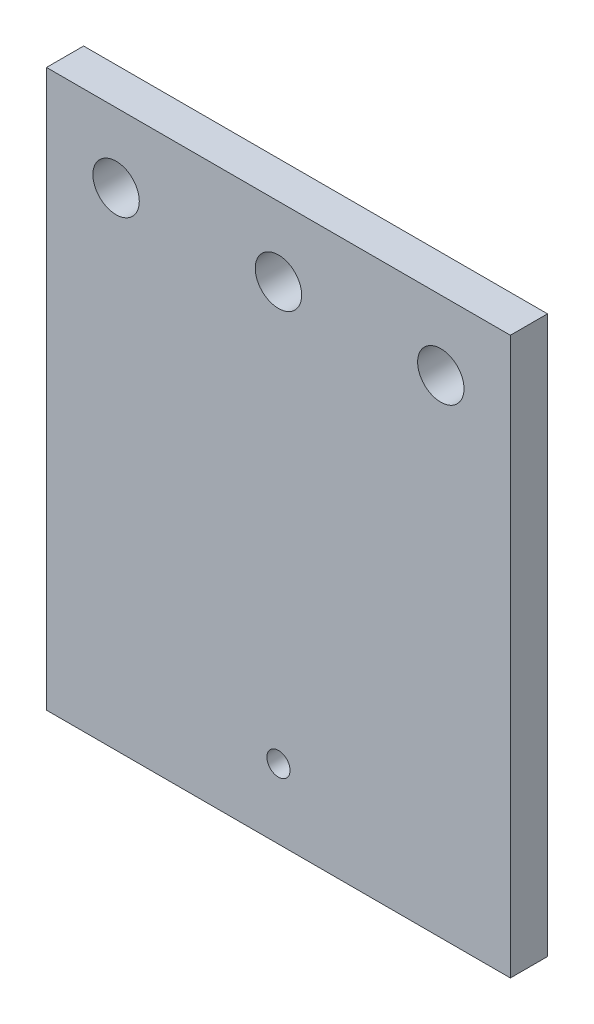
ISO-10303-21;
HEADER;
FILE_DESCRIPTION(('STEP AP214'),'2;1');
FILE_NAME('part.step','',(''),(''),'','','');
FILE_SCHEMA(('AUTOMOTIVE_DESIGN { 1 0 10303 214 1 1 1 1 }'));
ENDSEC;
DATA;
#1=APPLICATION_CONTEXT('core data for automotive mechanical design processes');
#2=APPLICATION_PROTOCOL_DEFINITION('international standard','automotive_design',2000,#1);
#3=PRODUCT_CONTEXT('',#1,'mechanical');
#4=PRODUCT('Part','Part','',(#3));
#5=PRODUCT_RELATED_PRODUCT_CATEGORY('part','',(#4));
#6=PRODUCT_DEFINITION_FORMATION('','',#4);
#7=PRODUCT_DEFINITION_CONTEXT('part definition',#1,'design');
#8=PRODUCT_DEFINITION('design','',#6,#7);
#9=PRODUCT_DEFINITION_SHAPE('','',#8);
#10=(LENGTH_UNIT() NAMED_UNIT(*) SI_UNIT(.MILLI.,.METRE.));
#11=(NAMED_UNIT(*) PLANE_ANGLE_UNIT() SI_UNIT($,.RADIAN.));
#12=(NAMED_UNIT(*) SI_UNIT($,.STERADIAN.) SOLID_ANGLE_UNIT());
#13=UNCERTAINTY_MEASURE_WITH_UNIT(LENGTH_MEASURE(1.E-05),#10,'distance_accuracy_value','');
#14=(GEOMETRIC_REPRESENTATION_CONTEXT(3) GLOBAL_UNCERTAINTY_ASSIGNED_CONTEXT((#13)) GLOBAL_UNIT_ASSIGNED_CONTEXT((#10,
#11,#12)) REPRESENTATION_CONTEXT('',''));
#15=CARTESIAN_POINT('',(0.,0.,0.));
#16=DIRECTION('',(0.,0.,1.));
#17=DIRECTION('',(1.,0.,0.));
#18=AXIS2_PLACEMENT_3D('',#15,#16,#17);
#19=CARTESIAN_POINT('',(0.,0.,10.16));
#20=DIRECTION('',(0.,0.,-1.));
#21=DIRECTION('',(-1.,0.,0.));
#22=AXIS2_PLACEMENT_3D('',#19,#20,#21);
#23=PLANE('',#22);
#24=DIRECTION('',(0.,-1.,0.));
#25=VECTOR('',#24,1.);
#26=CARTESIAN_POINT('',(0.,0.,10.16));
#27=LINE('',#26,#25);
#28=CARTESIAN_POINT('',(0.,152.4,10.16));
#29=VERTEX_POINT('',#28);
#30=CARTESIAN_POINT('',(0.,0.,10.16));
#31=VERTEX_POINT('',#30);
#32=EDGE_CURVE('E92',#29,#31,#27,.T.);
#33=ORIENTED_EDGE('',*,*,#32,.T.);
#34=DIRECTION('',(1.,0.,0.));
#35=VECTOR('',#34,1.);
#36=CARTESIAN_POINT('',(0.,0.,10.16));
#37=LINE('',#36,#35);
#38=CARTESIAN_POINT('',(127.,0.,10.16));
#39=VERTEX_POINT('',#38);
#40=EDGE_CURVE('E87',#31,#39,#37,.T.);
#41=ORIENTED_EDGE('',*,*,#40,.T.);
#42=DIRECTION('',(0.,1.,0.));
#43=VECTOR('',#42,1.);
#44=CARTESIAN_POINT('',(127.,0.,10.16));
#45=LINE('',#44,#43);
#46=CARTESIAN_POINT('',(127.,152.4,10.16));
#47=VERTEX_POINT('',#46);
#48=EDGE_CURVE('E90',#39,#47,#45,.T.);
#49=ORIENTED_EDGE('',*,*,#48,.T.);
#50=DIRECTION('',(-1.,0.,0.));
#51=VECTOR('',#50,1.);
#52=CARTESIAN_POINT('',(0.,152.4,10.16));
#53=LINE('',#52,#51);
#54=EDGE_CURVE('E57',#47,#29,#53,.T.);
#55=ORIENTED_EDGE('',*,*,#54,.T.);
#56=EDGE_LOOP('',(#33,#41,#49,#55));
#57=FACE_BOUND('',#56,.T.);
#58=CARTESIAN_POINT('',(63.5,19.05,10.16));
#59=DIRECTION('',(0.,0.,1.));
#60=DIRECTION('',(1.,0.,0.));
#61=AXIS2_PLACEMENT_3D('',#58,#59,#60);
#62=CIRCLE('',#61,3.175);
#63=CARTESIAN_POINT('',(66.675,19.05,10.16));
#64=VERTEX_POINT('',#63);
#65=EDGE_CURVE('E112',#64,#64,#62,.T.);
#66=ORIENTED_EDGE('',*,*,#65,.F.);
#67=EDGE_LOOP('',(#66));
#68=FACE_BOUND('',#67,.T.);
#69=CARTESIAN_POINT('',(19.05,133.35,10.16));
#70=DIRECTION('',(0.,0.,1.));
#71=DIRECTION('',(1.,0.,0.));
#72=AXIS2_PLACEMENT_3D('',#69,#70,#71);
#73=CIRCLE('',#72,6.35);
#74=CARTESIAN_POINT('',(25.4,133.35,10.16));
#75=VERTEX_POINT('',#74);
#76=EDGE_CURVE('E134',#75,#75,#73,.T.);
#77=ORIENTED_EDGE('',*,*,#76,.F.);
#78=EDGE_LOOP('',(#77));
#79=FACE_BOUND('',#78,.T.);
#80=CARTESIAN_POINT('',(63.5,133.35,10.16));
#81=DIRECTION('',(0.,0.,1.));
#82=DIRECTION('',(1.,0.,0.));
#83=AXIS2_PLACEMENT_3D('',#80,#81,#82);
#84=CIRCLE('',#83,6.34999999999999);
#85=CARTESIAN_POINT('',(69.85,133.35,10.16));
#86=VERTEX_POINT('',#85);
#87=EDGE_CURVE('E142',#86,#86,#84,.T.);
#88=ORIENTED_EDGE('',*,*,#87,.F.);
#89=EDGE_LOOP('',(#88));
#90=FACE_BOUND('',#89,.T.);
#91=CARTESIAN_POINT('',(107.95,133.35,10.16));
#92=DIRECTION('',(0.,0.,1.));
#93=DIRECTION('',(1.,0.,0.));
#94=AXIS2_PLACEMENT_3D('',#91,#92,#93);
#95=CIRCLE('',#94,6.34999999999999);
#96=CARTESIAN_POINT('',(114.3,133.35,10.16));
#97=VERTEX_POINT('',#96);
#98=EDGE_CURVE('E150',#97,#97,#95,.T.);
#99=ORIENTED_EDGE('',*,*,#98,.F.);
#100=EDGE_LOOP('',(#99));
#101=FACE_BOUND('',#100,.T.);
#102=ADVANCED_FACE('F39',(#57,#68,#79,#90,#101),#23,.F.);
#103=CARTESIAN_POINT('',(0.,0.,0.));
#104=DIRECTION('',(0.,0.,-1.));
#105=DIRECTION('',(-1.,0.,0.));
#106=AXIS2_PLACEMENT_3D('',#103,#104,#105);
#107=PLANE('',#106);
#108=CARTESIAN_POINT('',(63.5,133.35,0.));
#109=DIRECTION('',(0.,0.,1.));
#110=DIRECTION('',(1.,0.,0.));
#111=AXIS2_PLACEMENT_3D('',#108,#109,#110);
#112=CIRCLE('',#111,6.34999999999999);
#113=CARTESIAN_POINT('',(69.85,133.35,0.));
#114=VERTEX_POINT('',#113);
#115=EDGE_CURVE('E146',#114,#114,#112,.T.);
#116=ORIENTED_EDGE('',*,*,#115,.T.);
#117=EDGE_LOOP('',(#116));
#118=FACE_BOUND('',#117,.T.);
#119=CARTESIAN_POINT('',(63.5,19.05,0.));
#120=DIRECTION('',(0.,0.,1.));
#121=DIRECTION('',(1.,0.,0.));
#122=AXIS2_PLACEMENT_3D('',#119,#120,#121);
#123=CIRCLE('',#122,3.175);
#124=CARTESIAN_POINT('',(66.675,19.05,0.));
#125=VERTEX_POINT('',#124);
#126=EDGE_CURVE('E130',#125,#125,#123,.T.);
#127=ORIENTED_EDGE('',*,*,#126,.T.);
#128=EDGE_LOOP('',(#127));
#129=FACE_BOUND('',#128,.T.);
#130=DIRECTION('',(0.,-1.,0.));
#131=VECTOR('',#130,1.);
#132=CARTESIAN_POINT('',(0.,0.,0.));
#133=LINE('',#132,#131);
#134=CARTESIAN_POINT('',(0.,152.4,0.));
#135=VERTEX_POINT('',#134);
#136=CARTESIAN_POINT('',(0.,0.,0.));
#137=VERTEX_POINT('',#136);
#138=EDGE_CURVE('E108',#135,#137,#133,.T.);
#139=ORIENTED_EDGE('',*,*,#138,.F.);
#140=DIRECTION('',(-1.,0.,0.));
#141=VECTOR('',#140,1.);
#142=CARTESIAN_POINT('',(0.,152.4,0.));
#143=LINE('',#142,#141);
#144=CARTESIAN_POINT('',(127.,152.4,0.));
#145=VERTEX_POINT('',#144);
#146=EDGE_CURVE('E80',#145,#135,#143,.T.);
#147=ORIENTED_EDGE('',*,*,#146,.F.);
#148=DIRECTION('',(0.,1.,0.));
#149=VECTOR('',#148,1.);
#150=CARTESIAN_POINT('',(127.,0.,0.));
#151=LINE('',#150,#149);
#152=CARTESIAN_POINT('',(127.,0.,0.));
#153=VERTEX_POINT('',#152);
#154=EDGE_CURVE('E74',#153,#145,#151,.T.);
#155=ORIENTED_EDGE('',*,*,#154,.F.);
#156=DIRECTION('',(1.,0.,0.));
#157=VECTOR('',#156,1.);
#158=CARTESIAN_POINT('',(0.,0.,0.));
#159=LINE('',#158,#157);
#160=EDGE_CURVE('E97',#137,#153,#159,.T.);
#161=ORIENTED_EDGE('',*,*,#160,.F.);
#162=EDGE_LOOP('',(#139,#147,#155,#161));
#163=FACE_BOUND('',#162,.T.);
#164=CARTESIAN_POINT('',(19.05,133.35,0.));
#165=DIRECTION('',(0.,0.,1.));
#166=DIRECTION('',(1.,0.,0.));
#167=AXIS2_PLACEMENT_3D('',#164,#165,#166);
#168=CIRCLE('',#167,6.35);
#169=CARTESIAN_POINT('',(25.4,133.35,0.));
#170=VERTEX_POINT('',#169);
#171=EDGE_CURVE('E138',#170,#170,#168,.T.);
#172=ORIENTED_EDGE('',*,*,#171,.T.);
#173=EDGE_LOOP('',(#172));
#174=FACE_BOUND('',#173,.T.);
#175=CARTESIAN_POINT('',(107.95,133.35,0.));
#176=DIRECTION('',(0.,0.,1.));
#177=DIRECTION('',(1.,0.,0.));
#178=AXIS2_PLACEMENT_3D('',#175,#176,#177);
#179=CIRCLE('',#178,6.34999999999999);
#180=CARTESIAN_POINT('',(114.3,133.35,0.));
#181=VERTEX_POINT('',#180);
#182=EDGE_CURVE('E154',#181,#181,#179,.T.);
#183=ORIENTED_EDGE('',*,*,#182,.T.);
#184=EDGE_LOOP('',(#183));
#185=FACE_BOUND('',#184,.T.);
#186=ADVANCED_FACE('F125',(#118,#129,#163,#174,#185),#107,.T.);
#187=CARTESIAN_POINT('',(0.,0.,10.16));
#188=DIRECTION('',(1.,0.,0.));
#189=DIRECTION('',(0.,0.,-1.));
#190=AXIS2_PLACEMENT_3D('',#187,#188,#189);
#191=PLANE('',#190);
#192=ORIENTED_EDGE('',*,*,#138,.T.);
#193=DIRECTION('',(0.,0.,-1.));
#194=VECTOR('',#193,1.);
#195=CARTESIAN_POINT('',(0.,0.,10.16));
#196=LINE('',#195,#194);
#197=EDGE_CURVE('E11',#31,#137,#196,.T.);
#198=ORIENTED_EDGE('',*,*,#197,.F.);
#199=ORIENTED_EDGE('',*,*,#32,.F.);
#200=DIRECTION('',(0.,0.,-1.));
#201=VECTOR('',#200,1.);
#202=CARTESIAN_POINT('',(0.,152.4,10.16));
#203=LINE('',#202,#201);
#204=EDGE_CURVE('E104',#29,#135,#203,.T.);
#205=ORIENTED_EDGE('',*,*,#204,.T.);
#206=EDGE_LOOP('',(#192,#198,#199,#205));
#207=FACE_BOUND('',#206,.T.);
#208=ADVANCED_FACE('F41',(#207),#191,.F.);
#209=CARTESIAN_POINT('',(0.,0.,10.16));
#210=DIRECTION('',(0.,1.,0.));
#211=DIRECTION('',(0.,0.,1.));
#212=AXIS2_PLACEMENT_3D('',#209,#210,#211);
#213=PLANE('',#212);
#214=ORIENTED_EDGE('',*,*,#160,.T.);
#215=DIRECTION('',(0.,0.,-1.));
#216=VECTOR('',#215,1.);
#217=CARTESIAN_POINT('',(127.,0.,10.16));
#218=LINE('',#217,#216);
#219=EDGE_CURVE('E49',#39,#153,#218,.T.);
#220=ORIENTED_EDGE('',*,*,#219,.F.);
#221=ORIENTED_EDGE('',*,*,#40,.F.);
#222=ORIENTED_EDGE('',*,*,#197,.T.);
#223=EDGE_LOOP('',(#214,#220,#221,#222));
#224=FACE_BOUND('',#223,.T.);
#225=ADVANCED_FACE('F96',(#224),#213,.F.);
#226=CARTESIAN_POINT('',(127.,0.,10.16));
#227=DIRECTION('',(-1.,0.,0.));
#228=DIRECTION('',(0.,0.,1.));
#229=AXIS2_PLACEMENT_3D('',#226,#227,#228);
#230=PLANE('',#229);
#231=ORIENTED_EDGE('',*,*,#154,.T.);
#232=DIRECTION('',(0.,0.,-1.));
#233=VECTOR('',#232,1.);
#234=CARTESIAN_POINT('',(127.,152.4,10.16));
#235=LINE('',#234,#233);
#236=EDGE_CURVE('E99',#47,#145,#235,.T.);
#237=ORIENTED_EDGE('',*,*,#236,.F.);
#238=ORIENTED_EDGE('',*,*,#48,.F.);
#239=ORIENTED_EDGE('',*,*,#219,.T.);
#240=EDGE_LOOP('',(#231,#237,#238,#239));
#241=FACE_BOUND('',#240,.T.);
#242=ADVANCED_FACE('F100',(#241),#230,.F.);
#243=CARTESIAN_POINT('',(0.,152.4,10.16));
#244=DIRECTION('',(0.,-1.,0.));
#245=DIRECTION('',(0.,0.,-1.));
#246=AXIS2_PLACEMENT_3D('',#243,#244,#245);
#247=PLANE('',#246);
#248=ORIENTED_EDGE('',*,*,#146,.T.);
#249=ORIENTED_EDGE('',*,*,#204,.F.);
#250=ORIENTED_EDGE('',*,*,#54,.F.);
#251=ORIENTED_EDGE('',*,*,#236,.T.);
#252=EDGE_LOOP('',(#248,#249,#250,#251));
#253=FACE_BOUND('',#252,.T.);
#254=ADVANCED_FACE('F122',(#253),#247,.F.);
#255=CARTESIAN_POINT('',(63.5,19.05,10.16));
#256=DIRECTION('',(0.,0.,-1.));
#257=DIRECTION('',(-1.,0.,0.));
#258=AXIS2_PLACEMENT_3D('',#255,#256,#257);
#259=CYLINDRICAL_SURFACE('',#258,3.175);
#260=ORIENTED_EDGE('',*,*,#65,.T.);
#261=EDGE_LOOP('',(#260));
#262=FACE_BOUND('',#261,.T.);
#263=ORIENTED_EDGE('',*,*,#126,.F.);
#264=EDGE_LOOP('',(#263));
#265=FACE_BOUND('',#264,.T.);
#266=ADVANCED_FACE('F173',(#262,#265),#259,.F.);
#267=CARTESIAN_POINT('',(19.05,133.35,10.16));
#268=DIRECTION('',(0.,0.,-1.));
#269=DIRECTION('',(-1.,0.,0.));
#270=AXIS2_PLACEMENT_3D('',#267,#268,#269);
#271=CYLINDRICAL_SURFACE('',#270,6.35);
#272=ORIENTED_EDGE('',*,*,#76,.T.);
#273=EDGE_LOOP('',(#272));
#274=FACE_BOUND('',#273,.T.);
#275=ORIENTED_EDGE('',*,*,#171,.F.);
#276=EDGE_LOOP('',(#275));
#277=FACE_BOUND('',#276,.T.);
#278=ADVANCED_FACE('F219',(#274,#277),#271,.F.);
#279=CARTESIAN_POINT('',(63.5,133.35,10.16));
#280=DIRECTION('',(0.,0.,-1.));
#281=DIRECTION('',(-1.,0.,0.));
#282=AXIS2_PLACEMENT_3D('',#279,#280,#281);
#283=CYLINDRICAL_SURFACE('',#282,6.34999999999999);
#284=ORIENTED_EDGE('',*,*,#87,.T.);
#285=EDGE_LOOP('',(#284));
#286=FACE_BOUND('',#285,.T.);
#287=ORIENTED_EDGE('',*,*,#115,.F.);
#288=EDGE_LOOP('',(#287));
#289=FACE_BOUND('',#288,.T.);
#290=ADVANCED_FACE('F227',(#286,#289),#283,.F.);
#291=CARTESIAN_POINT('',(107.95,133.35,10.16));
#292=DIRECTION('',(0.,0.,-1.));
#293=DIRECTION('',(-1.,0.,0.));
#294=AXIS2_PLACEMENT_3D('',#291,#292,#293);
#295=CYLINDRICAL_SURFACE('',#294,6.34999999999999);
#296=ORIENTED_EDGE('',*,*,#98,.T.);
#297=EDGE_LOOP('',(#296));
#298=FACE_BOUND('',#297,.T.);
#299=ORIENTED_EDGE('',*,*,#182,.F.);
#300=EDGE_LOOP('',(#299));
#301=FACE_BOUND('',#300,.T.);
#302=ADVANCED_FACE('F162',(#298,#301),#295,.F.);
#303=CLOSED_SHELL('',(#102,#186,#208,#225,#242,#254,#266,#278,#290,#302));
#304=MANIFOLD_SOLID_BREP('B2',#303);
#305=ADVANCED_BREP_SHAPE_REPRESENTATION('',(#18,#304),#14);
#306=SHAPE_DEFINITION_REPRESENTATION(#9,#305);
ENDSEC;
END-ISO-10303-21;
